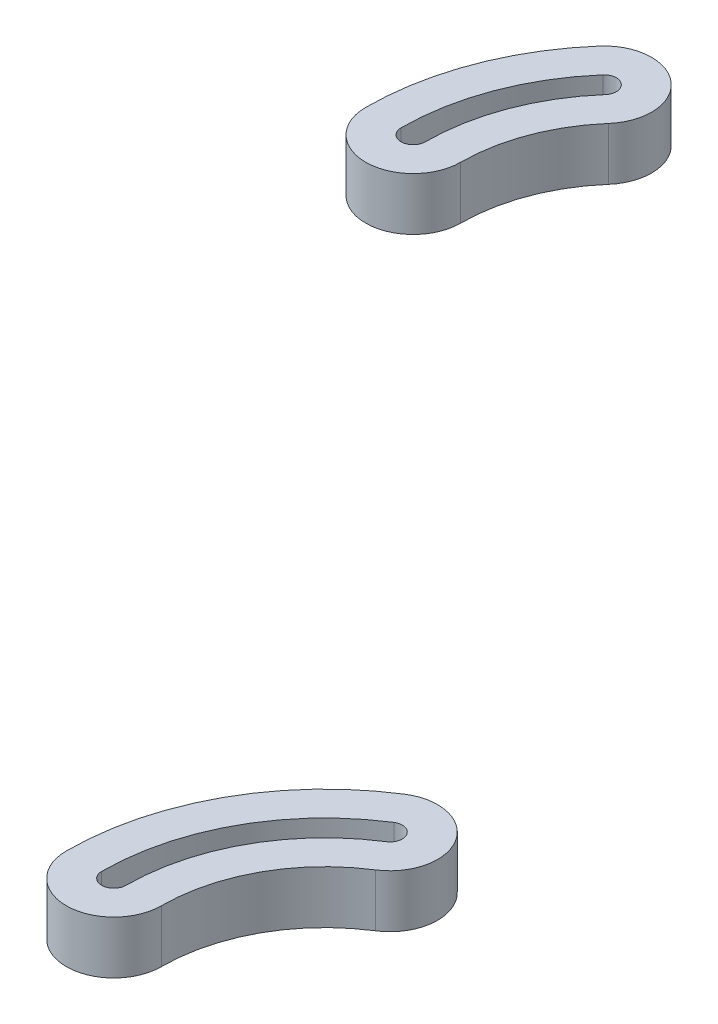
ISO-10303-21;
HEADER;
FILE_DESCRIPTION(('STEP AP214'),'2;1');
FILE_NAME('part.step','',(''),(''),'','','');
FILE_SCHEMA(('AUTOMOTIVE_DESIGN { 1 0 10303 214 1 1 1 1 }'));
ENDSEC;
DATA;
#1=APPLICATION_CONTEXT('core data for automotive mechanical design processes');
#2=APPLICATION_PROTOCOL_DEFINITION('international standard','automotive_design',2000,#1);
#3=PRODUCT_CONTEXT('',#1,'mechanical');
#4=PRODUCT('Part','Part','',(#3));
#5=PRODUCT_RELATED_PRODUCT_CATEGORY('part','',(#4));
#6=PRODUCT_DEFINITION_FORMATION('','',#4);
#7=PRODUCT_DEFINITION_CONTEXT('part definition',#1,'design');
#8=PRODUCT_DEFINITION('design','',#6,#7);
#9=PRODUCT_DEFINITION_SHAPE('','',#8);
#10=(LENGTH_UNIT() NAMED_UNIT(*) SI_UNIT(.MILLI.,.METRE.));
#11=(NAMED_UNIT(*) PLANE_ANGLE_UNIT() SI_UNIT($,.RADIAN.));
#12=(NAMED_UNIT(*) SI_UNIT($,.STERADIAN.) SOLID_ANGLE_UNIT());
#13=UNCERTAINTY_MEASURE_WITH_UNIT(LENGTH_MEASURE(1.E-05),#10,'distance_accuracy_value','');
#14=(GEOMETRIC_REPRESENTATION_CONTEXT(3) GLOBAL_UNCERTAINTY_ASSIGNED_CONTEXT((#13)) GLOBAL_UNIT_ASSIGNED_CONTEXT((#10,
#11,#12)) REPRESENTATION_CONTEXT('',''));
#15=CARTESIAN_POINT('',(0.,0.,0.));
#16=DIRECTION('',(0.,0.,1.));
#17=DIRECTION('',(1.,0.,0.));
#18=AXIS2_PLACEMENT_3D('',#15,#16,#17);
#19=CARTESIAN_POINT('',(-179.166238959109,445.3,261.544556892225));
#20=DIRECTION('',(0.,1.,0.));
#21=DIRECTION('',(0.,0.,1.));
#22=AXIS2_PLACEMENT_3D('',#19,#20,#21);
#23=CYLINDRICAL_SURFACE('',#22,49.);
#24=CARTESIAN_POINT('',(-179.166238959109,455.3,261.544556892225));
#25=DIRECTION('',(0.,1.,0.));
#26=DIRECTION('',(0.,0.,1.));
#27=AXIS2_PLACEMENT_3D('',#24,#25,#26);
#28=CIRCLE('',#27,49.);
#29=CARTESIAN_POINT('',(-216.072963974037,455.3,229.312683712521));
#30=VERTEX_POINT('',#29);
#31=CARTESIAN_POINT('',(-228.166238959109,455.3,261.544556892225));
#32=VERTEX_POINT('',#31);
#33=EDGE_CURVE('E142',#30,#32,#28,.T.);
#34=ORIENTED_EDGE('',*,*,#33,.F.);
#35=DIRECTION('',(0.,1.,0.));
#36=VECTOR('',#35,1.);
#37=CARTESIAN_POINT('',(-216.072963974037,445.3,229.312683712521));
#38=LINE('',#37,#36);
#39=CARTESIAN_POINT('',(-216.072963974037,445.3,229.312683712521));
#40=VERTEX_POINT('',#39);
#41=EDGE_CURVE('E12',#40,#30,#38,.T.);
#42=ORIENTED_EDGE('',*,*,#41,.F.);
#43=CARTESIAN_POINT('',(-179.166238959109,445.3,261.544556892225));
#44=DIRECTION('',(0.,1.,0.));
#45=DIRECTION('',(0.,0.,1.));
#46=AXIS2_PLACEMENT_3D('',#43,#44,#45);
#47=CIRCLE('',#46,49.);
#48=CARTESIAN_POINT('',(-228.166238959109,445.3,261.544556892225));
#49=VERTEX_POINT('',#48);
#50=EDGE_CURVE('E146',#40,#49,#47,.T.);
#51=ORIENTED_EDGE('',*,*,#50,.T.);
#52=DIRECTION('',(0.,1.,0.));
#53=VECTOR('',#52,1.);
#54=CARTESIAN_POINT('',(-228.166238959109,445.3,261.544556892225));
#55=LINE('',#54,#53);
#56=EDGE_CURVE('E47',#49,#32,#55,.T.);
#57=ORIENTED_EDGE('',*,*,#56,.T.);
#58=EDGE_LOOP('',(#34,#42,#51,#57));
#59=FACE_BOUND('',#58,.T.);
#60=ADVANCED_FACE('F44',(#59),#23,.T.);
#61=CARTESIAN_POINT('',(-209.294177746805,445.3,235.232823684304));
#62=DIRECTION('',(0.,1.,0.));
#63=DIRECTION('',(0.,0.,1.));
#64=AXIS2_PLACEMENT_3D('',#61,#62,#63);
#65=CYLINDRICAL_SURFACE('',#64,9.00000000000003);
#66=CARTESIAN_POINT('',(-209.294177746805,455.3,235.232823684304));
#67=DIRECTION('',(0.,1.,0.));
#68=DIRECTION('',(0.,0.,1.));
#69=AXIS2_PLACEMENT_3D('',#66,#67,#68);
#70=CIRCLE('',#69,9.00000000000003);
#71=CARTESIAN_POINT('',(-202.515391519574,455.3,241.152963656086));
#72=VERTEX_POINT('',#71);
#73=EDGE_CURVE('E150',#72,#30,#70,.T.);
#74=ORIENTED_EDGE('',*,*,#73,.F.);
#75=DIRECTION('',(0.,1.,0.));
#76=VECTOR('',#75,1.);
#77=CARTESIAN_POINT('',(-202.515391519574,445.3,241.152963656086));
#78=LINE('',#77,#76);
#79=CARTESIAN_POINT('',(-202.515391519574,445.3,241.152963656086));
#80=VERTEX_POINT('',#79);
#81=EDGE_CURVE('E52',#80,#72,#78,.T.);
#82=ORIENTED_EDGE('',*,*,#81,.F.);
#83=CARTESIAN_POINT('',(-209.294177746805,445.3,235.232823684304));
#84=DIRECTION('',(0.,1.,0.));
#85=DIRECTION('',(0.,0.,1.));
#86=AXIS2_PLACEMENT_3D('',#83,#84,#85);
#87=CIRCLE('',#86,9.00000000000003);
#88=EDGE_CURVE('E156',#80,#40,#87,.T.);
#89=ORIENTED_EDGE('',*,*,#88,.T.);
#90=ORIENTED_EDGE('',*,*,#41,.T.);
#91=EDGE_LOOP('',(#74,#82,#89,#90));
#92=FACE_BOUND('',#91,.T.);
#93=ADVANCED_FACE('F182',(#92),#65,.T.);
#94=CARTESIAN_POINT('',(-179.166238959109,445.3,261.544556892225));
#95=DIRECTION('',(0.,1.,0.));
#96=DIRECTION('',(0.,0.,1.));
#97=AXIS2_PLACEMENT_3D('',#94,#95,#96);
#98=CYLINDRICAL_SURFACE('',#97,31.);
#99=CARTESIAN_POINT('',(-179.166238959109,455.3,261.544556892225));
#100=DIRECTION('',(0.,-1.,0.));
#101=DIRECTION('',(0.,0.,1.));
#102=AXIS2_PLACEMENT_3D('',#99,#100,#101);
#103=CIRCLE('',#102,31.);
#104=CARTESIAN_POINT('',(-210.166238959109,455.3,261.544556892225));
#105=VERTEX_POINT('',#104);
#106=EDGE_CURVE('E164',#105,#72,#103,.T.);
#107=ORIENTED_EDGE('',*,*,#106,.F.);
#108=DIRECTION('',(0.,1.,0.));
#109=VECTOR('',#108,1.);
#110=CARTESIAN_POINT('',(-210.166238959109,445.3,261.544556892225));
#111=LINE('',#110,#109);
#112=CARTESIAN_POINT('',(-210.166238959109,445.3,261.544556892225));
#113=VERTEX_POINT('',#112);
#114=EDGE_CURVE('E169',#113,#105,#111,.T.);
#115=ORIENTED_EDGE('',*,*,#114,.F.);
#116=CARTESIAN_POINT('',(-179.166238959109,445.3,261.544556892225));
#117=DIRECTION('',(0.,-1.,0.));
#118=DIRECTION('',(0.,0.,1.));
#119=AXIS2_PLACEMENT_3D('',#116,#117,#118);
#120=CIRCLE('',#119,31.);
#121=EDGE_CURVE('E153',#113,#80,#120,.T.);
#122=ORIENTED_EDGE('',*,*,#121,.T.);
#123=ORIENTED_EDGE('',*,*,#81,.T.);
#124=EDGE_LOOP('',(#107,#115,#122,#123));
#125=FACE_BOUND('',#124,.T.);
#126=ADVANCED_FACE('F186',(#125),#98,.F.);
#127=CARTESIAN_POINT('',(-219.166238959109,445.3,261.544556892225));
#128=DIRECTION('',(0.,1.,0.));
#129=DIRECTION('',(0.,0.,1.));
#130=AXIS2_PLACEMENT_3D('',#127,#128,#129);
#131=CYLINDRICAL_SURFACE('',#130,9.00000000000001);
#132=CARTESIAN_POINT('',(-219.166238959109,455.3,261.544556892225));
#133=DIRECTION('',(0.,1.,0.));
#134=DIRECTION('',(0.,0.,1.));
#135=AXIS2_PLACEMENT_3D('',#132,#133,#134);
#136=CIRCLE('',#135,9.00000000000001);
#137=EDGE_CURVE('E161',#32,#105,#136,.T.);
#138=ORIENTED_EDGE('',*,*,#137,.F.);
#139=ORIENTED_EDGE('',*,*,#56,.F.);
#140=CARTESIAN_POINT('',(-219.166238959109,445.3,261.544556892225));
#141=DIRECTION('',(0.,1.,0.));
#142=DIRECTION('',(0.,0.,1.));
#143=AXIS2_PLACEMENT_3D('',#140,#141,#142);
#144=CIRCLE('',#143,9.00000000000001);
#145=EDGE_CURVE('E149',#49,#113,#144,.T.);
#146=ORIENTED_EDGE('',*,*,#145,.T.);
#147=ORIENTED_EDGE('',*,*,#114,.T.);
#148=EDGE_LOOP('',(#138,#139,#146,#147));
#149=FACE_BOUND('',#148,.T.);
#150=ADVANCED_FACE('F177',(#149),#131,.T.);
#151=CARTESIAN_POINT('',(-199.166238959109,445.3,261.544556892225));
#152=DIRECTION('',(0.,1.,0.));
#153=DIRECTION('',(0.,0.,1.));
#154=AXIS2_PLACEMENT_3D('',#151,#152,#153);
#155=PLANE('',#154);
#156=CARTESIAN_POINT('',(-209.294177746805,445.3,235.232823684304));
#157=DIRECTION('',(0.,1.,0.));
#158=DIRECTION('',(0.,0.,1.));
#159=AXIS2_PLACEMENT_3D('',#156,#157,#158);
#160=CIRCLE('',#159,2.30000000000002);
#161=CARTESIAN_POINT('',(-207.561821266513,445.3,236.745748343759));
#162=VERTEX_POINT('',#161);
#163=CARTESIAN_POINT('',(-211.026534227098,445.3,233.719899024848));
#164=VERTEX_POINT('',#163);
#165=EDGE_CURVE('E117',#162,#164,#160,.T.);
#166=ORIENTED_EDGE('',*,*,#165,.T.);
#167=CARTESIAN_POINT('',(-179.166238959109,445.3,261.544556892225));
#168=DIRECTION('',(0.,1.,0.));
#169=DIRECTION('',(0.,0.,1.));
#170=AXIS2_PLACEMENT_3D('',#167,#168,#169);
#171=CIRCLE('',#170,42.3);
#172=CARTESIAN_POINT('',(-221.466238959109,445.3,261.544556892225));
#173=VERTEX_POINT('',#172);
#174=EDGE_CURVE('E111',#164,#173,#171,.T.);
#175=ORIENTED_EDGE('',*,*,#174,.T.);
#176=CARTESIAN_POINT('',(-219.166238959109,445.3,261.544556892225));
#177=DIRECTION('',(0.,1.,0.));
#178=DIRECTION('',(0.,0.,1.));
#179=AXIS2_PLACEMENT_3D('',#176,#177,#178);
#180=CIRCLE('',#179,2.30000000000002);
#181=CARTESIAN_POINT('',(-216.866238959109,445.3,261.544556892225));
#182=VERTEX_POINT('',#181);
#183=EDGE_CURVE('E120',#173,#182,#180,.T.);
#184=ORIENTED_EDGE('',*,*,#183,.T.);
#185=CARTESIAN_POINT('',(-179.166238959109,445.3,261.544556892225));
#186=DIRECTION('',(0.,-1.,0.));
#187=DIRECTION('',(0.,0.,1.));
#188=AXIS2_PLACEMENT_3D('',#185,#186,#187);
#189=CIRCLE('',#188,37.7);
#190=EDGE_CURVE('E60',#182,#162,#189,.T.);
#191=ORIENTED_EDGE('',*,*,#190,.T.);
#192=EDGE_LOOP('',(#166,#175,#184,#191));
#193=FACE_BOUND('',#192,.T.);
#194=ORIENTED_EDGE('',*,*,#50,.F.);
#195=ORIENTED_EDGE('',*,*,#88,.F.);
#196=ORIENTED_EDGE('',*,*,#121,.F.);
#197=ORIENTED_EDGE('',*,*,#145,.F.);
#198=EDGE_LOOP('',(#194,#195,#196,#197));
#199=FACE_BOUND('',#198,.T.);
#200=ADVANCED_FACE('F124',(#193,#199),#155,.F.);
#201=CARTESIAN_POINT('',(-199.166238959109,455.3,261.544556892225));
#202=DIRECTION('',(0.,1.,0.));
#203=DIRECTION('',(0.,0.,1.));
#204=AXIS2_PLACEMENT_3D('',#201,#202,#203);
#205=PLANE('',#204);
#206=CARTESIAN_POINT('',(-179.166238959109,455.3,261.544556892225));
#207=DIRECTION('',(0.,1.,0.));
#208=DIRECTION('',(0.,0.,1.));
#209=AXIS2_PLACEMENT_3D('',#206,#207,#208);
#210=CIRCLE('',#209,42.3);
#211=CARTESIAN_POINT('',(-211.026534227098,455.3,233.719899024848));
#212=VERTEX_POINT('',#211);
#213=CARTESIAN_POINT('',(-221.466238959109,455.3,261.544556892225));
#214=VERTEX_POINT('',#213);
#215=EDGE_CURVE('E68',#212,#214,#210,.T.);
#216=ORIENTED_EDGE('',*,*,#215,.F.);
#217=CARTESIAN_POINT('',(-209.294177746805,455.3,235.232823684304));
#218=DIRECTION('',(0.,1.,0.));
#219=DIRECTION('',(0.,0.,1.));
#220=AXIS2_PLACEMENT_3D('',#217,#218,#219);
#221=CIRCLE('',#220,2.30000000000002);
#222=CARTESIAN_POINT('',(-207.561821266513,455.3,236.745748343759));
#223=VERTEX_POINT('',#222);
#224=EDGE_CURVE('E127',#223,#212,#221,.T.);
#225=ORIENTED_EDGE('',*,*,#224,.F.);
#226=CARTESIAN_POINT('',(-179.166238959109,455.3,261.544556892225));
#227=DIRECTION('',(0.,-1.,0.));
#228=DIRECTION('',(0.,0.,1.));
#229=AXIS2_PLACEMENT_3D('',#226,#227,#228);
#230=CIRCLE('',#229,37.7);
#231=CARTESIAN_POINT('',(-216.866238959109,455.3,261.544556892225));
#232=VERTEX_POINT('',#231);
#233=EDGE_CURVE('E130',#232,#223,#230,.T.);
#234=ORIENTED_EDGE('',*,*,#233,.F.);
#235=CARTESIAN_POINT('',(-219.166238959109,455.3,261.544556892225));
#236=DIRECTION('',(0.,1.,0.));
#237=DIRECTION('',(0.,0.,1.));
#238=AXIS2_PLACEMENT_3D('',#235,#236,#237);
#239=CIRCLE('',#238,2.30000000000002);
#240=EDGE_CURVE('E136',#214,#232,#239,.T.);
#241=ORIENTED_EDGE('',*,*,#240,.F.);
#242=EDGE_LOOP('',(#216,#225,#234,#241));
#243=FACE_BOUND('',#242,.T.);
#244=ORIENTED_EDGE('',*,*,#33,.T.);
#245=ORIENTED_EDGE('',*,*,#137,.T.);
#246=ORIENTED_EDGE('',*,*,#106,.T.);
#247=ORIENTED_EDGE('',*,*,#73,.T.);
#248=EDGE_LOOP('',(#244,#245,#246,#247));
#249=FACE_BOUND('',#248,.T.);
#250=ADVANCED_FACE('F179',(#243,#249),#205,.T.);
#251=CARTESIAN_POINT('',(-179.166238959109,445.3,261.544556892225));
#252=DIRECTION('',(0.,1.,0.));
#253=DIRECTION('',(0.,0.,1.));
#254=AXIS2_PLACEMENT_3D('',#251,#252,#253);
#255=CYLINDRICAL_SURFACE('',#254,42.3);
#256=ORIENTED_EDGE('',*,*,#215,.T.);
#257=DIRECTION('',(0.,1.,0.));
#258=VECTOR('',#257,1.);
#259=CARTESIAN_POINT('',(-221.466238959109,445.3,261.544556892225));
#260=LINE('',#259,#258);
#261=EDGE_CURVE('E107',#173,#214,#260,.T.);
#262=ORIENTED_EDGE('',*,*,#261,.F.);
#263=ORIENTED_EDGE('',*,*,#174,.F.);
#264=DIRECTION('',(0.,1.,0.));
#265=VECTOR('',#264,1.);
#266=CARTESIAN_POINT('',(-211.026534227098,445.3,233.719899024848));
#267=LINE('',#266,#265);
#268=EDGE_CURVE('E140',#164,#212,#267,.T.);
#269=ORIENTED_EDGE('',*,*,#268,.T.);
#270=EDGE_LOOP('',(#256,#262,#263,#269));
#271=FACE_BOUND('',#270,.T.);
#272=ADVANCED_FACE('F109',(#271),#255,.F.);
#273=CARTESIAN_POINT('',(-209.294177746805,445.3,235.232823684304));
#274=DIRECTION('',(0.,1.,0.));
#275=DIRECTION('',(0.,0.,1.));
#276=AXIS2_PLACEMENT_3D('',#273,#274,#275);
#277=CYLINDRICAL_SURFACE('',#276,2.30000000000002);
#278=ORIENTED_EDGE('',*,*,#224,.T.);
#279=ORIENTED_EDGE('',*,*,#268,.F.);
#280=ORIENTED_EDGE('',*,*,#165,.F.);
#281=DIRECTION('',(0.,1.,0.));
#282=VECTOR('',#281,1.);
#283=CARTESIAN_POINT('',(-207.561821266513,445.3,236.745748343759));
#284=LINE('',#283,#282);
#285=EDGE_CURVE('E143',#162,#223,#284,.T.);
#286=ORIENTED_EDGE('',*,*,#285,.T.);
#287=EDGE_LOOP('',(#278,#279,#280,#286));
#288=FACE_BOUND('',#287,.T.);
#289=ADVANCED_FACE('F237',(#288),#277,.F.);
#290=CARTESIAN_POINT('',(-179.166238959109,445.3,261.544556892225));
#291=DIRECTION('',(0.,1.,0.));
#292=DIRECTION('',(0.,0.,1.));
#293=AXIS2_PLACEMENT_3D('',#290,#291,#292);
#294=CYLINDRICAL_SURFACE('',#293,37.7);
#295=ORIENTED_EDGE('',*,*,#233,.T.);
#296=ORIENTED_EDGE('',*,*,#285,.F.);
#297=ORIENTED_EDGE('',*,*,#190,.F.);
#298=DIRECTION('',(0.,1.,0.));
#299=VECTOR('',#298,1.);
#300=CARTESIAN_POINT('',(-216.866238959109,445.3,261.544556892225));
#301=LINE('',#300,#299);
#302=EDGE_CURVE('E116',#182,#232,#301,.T.);
#303=ORIENTED_EDGE('',*,*,#302,.T.);
#304=EDGE_LOOP('',(#295,#296,#297,#303));
#305=FACE_BOUND('',#304,.T.);
#306=ADVANCED_FACE('F246',(#305),#294,.T.);
#307=CARTESIAN_POINT('',(-219.166238959109,445.3,261.544556892225));
#308=DIRECTION('',(0.,1.,0.));
#309=DIRECTION('',(0.,0.,1.));
#310=AXIS2_PLACEMENT_3D('',#307,#308,#309);
#311=CYLINDRICAL_SURFACE('',#310,2.30000000000002);
#312=ORIENTED_EDGE('',*,*,#240,.T.);
#313=ORIENTED_EDGE('',*,*,#302,.F.);
#314=ORIENTED_EDGE('',*,*,#183,.F.);
#315=ORIENTED_EDGE('',*,*,#261,.T.);
#316=EDGE_LOOP('',(#312,#313,#314,#315));
#317=FACE_BOUND('',#316,.T.);
#318=ADVANCED_FACE('F121',(#317),#311,.F.);
#319=CLOSED_SHELL('',(#60,#93,#126,#150,#200,#250,#272,#289,#306,#318));
#320=MANIFOLD_SOLID_BREP('B2',#319);
#321=CARTESIAN_POINT('',(-106.941386536485,445.3,378.14410632055));
#322=DIRECTION('',(0.,1.,0.));
#323=DIRECTION('',(0.,0.,1.));
#324=AXIS2_PLACEMENT_3D('',#321,#322,#323);
#325=CYLINDRICAL_SURFACE('',#324,9.00000000000001);
#326=CARTESIAN_POINT('',(-106.941386536485,455.3,378.14410632055));
#327=DIRECTION('',(0.,1.,0.));
#328=DIRECTION('',(0.,0.,1.));
#329=AXIS2_PLACEMENT_3D('',#326,#327,#328);
#330=CIRCLE('',#329,9.00000000000001);
#331=CARTESIAN_POINT('',(-102.120119655251,455.3,385.743802739482));
#332=VERTEX_POINT('',#331);
#333=CARTESIAN_POINT('',(-111.762653417718,455.3,370.544409901618));
#334=VERTEX_POINT('',#333);
#335=EDGE_CURVE('E371',#332,#334,#330,.T.);
#336=ORIENTED_EDGE('',*,*,#335,.F.);
#337=DIRECTION('',(0.,1.,0.));
#338=VECTOR('',#337,1.);
#339=CARTESIAN_POINT('',(-102.120119655251,445.3,385.743802739482));
#340=LINE('',#339,#338);
#341=CARTESIAN_POINT('',(-102.120119655251,445.3,385.743802739482));
#342=VERTEX_POINT('',#341);
#343=EDGE_CURVE('E42',#342,#332,#340,.T.);
#344=ORIENTED_EDGE('',*,*,#343,.F.);
#345=CARTESIAN_POINT('',(-106.941386536485,445.3,378.14410632055));
#346=DIRECTION('',(0.,1.,0.));
#347=DIRECTION('',(0.,0.,1.));
#348=AXIS2_PLACEMENT_3D('',#345,#346,#347);
#349=CIRCLE('',#348,9.00000000000001);
#350=CARTESIAN_POINT('',(-111.762653417718,445.3,370.544409901618));
#351=VERTEX_POINT('',#350);
#352=EDGE_CURVE('E375',#342,#351,#349,.T.);
#353=ORIENTED_EDGE('',*,*,#352,.T.);
#354=DIRECTION('',(0.,1.,0.));
#355=VECTOR('',#354,1.);
#356=CARTESIAN_POINT('',(-111.762653417718,445.3,370.544409901618));
#357=LINE('',#356,#355);
#358=EDGE_CURVE('E276',#351,#334,#357,.T.);
#359=ORIENTED_EDGE('',*,*,#358,.T.);
#360=EDGE_LOOP('',(#336,#344,#353,#359));
#361=FACE_BOUND('',#360,.T.);
#362=ADVANCED_FACE('F273',(#361),#325,.T.);
#363=CARTESIAN_POINT('',(-85.5135337310029,445.3,411.920534849135));
#364=DIRECTION('',(0.,1.,0.));
#365=DIRECTION('',(0.,0.,1.));
#366=AXIS2_PLACEMENT_3D('',#363,#364,#365);
#367=CYLINDRICAL_SURFACE('',#366,31.);
#368=CARTESIAN_POINT('',(-85.5135337310029,455.3,411.920534849135));
#369=DIRECTION('',(0.,-1.,0.));
#370=DIRECTION('',(0.,0.,1.));
#371=AXIS2_PLACEMENT_3D('',#368,#369,#370);
#372=CIRCLE('',#371,31.);
#373=CARTESIAN_POINT('',(-116.513533731003,455.3,411.920534849135));
#374=VERTEX_POINT('',#373);
#375=EDGE_CURVE('E379',#374,#332,#372,.T.);
#376=ORIENTED_EDGE('',*,*,#375,.F.);
#377=DIRECTION('',(0.,1.,0.));
#378=VECTOR('',#377,1.);
#379=CARTESIAN_POINT('',(-116.513533731003,445.3,411.920534849135));
#380=LINE('',#379,#378);
#381=CARTESIAN_POINT('',(-116.513533731003,445.3,411.920534849135));
#382=VERTEX_POINT('',#381);
#383=EDGE_CURVE('E281',#382,#374,#380,.T.);
#384=ORIENTED_EDGE('',*,*,#383,.F.);
#385=CARTESIAN_POINT('',(-85.5135337310029,445.3,411.920534849135));
#386=DIRECTION('',(0.,-1.,0.));
#387=DIRECTION('',(0.,0.,1.));
#388=AXIS2_PLACEMENT_3D('',#385,#386,#387);
#389=CIRCLE('',#388,31.);
#390=EDGE_CURVE('E385',#382,#342,#389,.T.);
#391=ORIENTED_EDGE('',*,*,#390,.T.);
#392=ORIENTED_EDGE('',*,*,#343,.T.);
#393=EDGE_LOOP('',(#376,#384,#391,#392));
#394=FACE_BOUND('',#393,.T.);
#395=ADVANCED_FACE('F411',(#394),#367,.F.);
#396=CARTESIAN_POINT('',(-125.513533731003,445.3,411.920534849135));
#397=DIRECTION('',(0.,1.,0.));
#398=DIRECTION('',(0.,0.,1.));
#399=AXIS2_PLACEMENT_3D('',#396,#397,#398);
#400=CYLINDRICAL_SURFACE('',#399,9.00000000000001);
#401=CARTESIAN_POINT('',(-125.513533731003,455.3,411.920534849135));
#402=DIRECTION('',(0.,1.,0.));
#403=DIRECTION('',(0.,0.,1.));
#404=AXIS2_PLACEMENT_3D('',#401,#402,#403);
#405=CIRCLE('',#404,9.00000000000001);
#406=CARTESIAN_POINT('',(-134.513533731003,455.3,411.920534849135));
#407=VERTEX_POINT('',#406);
#408=EDGE_CURVE('E393',#407,#374,#405,.T.);
#409=ORIENTED_EDGE('',*,*,#408,.F.);
#410=DIRECTION('',(0.,1.,0.));
#411=VECTOR('',#410,1.);
#412=CARTESIAN_POINT('',(-134.513533731003,445.3,411.920534849135));
#413=LINE('',#412,#411);
#414=CARTESIAN_POINT('',(-134.513533731003,445.3,411.920534849135));
#415=VERTEX_POINT('',#414);
#416=EDGE_CURVE('E398',#415,#407,#413,.T.);
#417=ORIENTED_EDGE('',*,*,#416,.F.);
#418=CARTESIAN_POINT('',(-125.513533731003,445.3,411.920534849135));
#419=DIRECTION('',(0.,1.,0.));
#420=DIRECTION('',(0.,0.,1.));
#421=AXIS2_PLACEMENT_3D('',#418,#419,#420);
#422=CIRCLE('',#421,9.00000000000001);
#423=EDGE_CURVE('E382',#415,#382,#422,.T.);
#424=ORIENTED_EDGE('',*,*,#423,.T.);
#425=ORIENTED_EDGE('',*,*,#383,.T.);
#426=EDGE_LOOP('',(#409,#417,#424,#425));
#427=FACE_BOUND('',#426,.T.);
#428=ADVANCED_FACE('F415',(#427),#400,.T.);
#429=CARTESIAN_POINT('',(-85.5135337310029,445.3,411.920534849135));
#430=DIRECTION('',(0.,1.,0.));
#431=DIRECTION('',(0.,0.,1.));
#432=AXIS2_PLACEMENT_3D('',#429,#430,#431);
#433=CYLINDRICAL_SURFACE('',#432,49.);
#434=CARTESIAN_POINT('',(-85.5135337310029,455.3,411.920534849135));
#435=DIRECTION('',(0.,1.,0.));
#436=DIRECTION('',(0.,0.,1.));
#437=AXIS2_PLACEMENT_3D('',#434,#435,#436);
#438=CIRCLE('',#437,49.);
#439=EDGE_CURVE('E390',#334,#407,#438,.T.);
#440=ORIENTED_EDGE('',*,*,#439,.F.);
#441=ORIENTED_EDGE('',*,*,#358,.F.);
#442=CARTESIAN_POINT('',(-85.5135337310029,445.3,411.920534849135));
#443=DIRECTION('',(0.,1.,0.));
#444=DIRECTION('',(0.,0.,1.));
#445=AXIS2_PLACEMENT_3D('',#442,#443,#444);
#446=CIRCLE('',#445,49.);
#447=EDGE_CURVE('E378',#351,#415,#446,.T.);
#448=ORIENTED_EDGE('',*,*,#447,.T.);
#449=ORIENTED_EDGE('',*,*,#416,.T.);
#450=EDGE_LOOP('',(#440,#441,#448,#449));
#451=FACE_BOUND('',#450,.T.);
#452=ADVANCED_FACE('F406',(#451),#433,.T.);
#453=CARTESIAN_POINT('',(-96.2274601337438,445.3,395.032320584842));
#454=DIRECTION('',(0.,1.,0.));
#455=DIRECTION('',(0.,0.,1.));
#456=AXIS2_PLACEMENT_3D('',#453,#454,#455);
#457=PLANE('',#456);
#458=CARTESIAN_POINT('',(-106.941386536485,445.3,378.14410632055));
#459=DIRECTION('',(0.,1.,0.));
#460=DIRECTION('',(0.,0.,1.));
#461=AXIS2_PLACEMENT_3D('',#458,#459,#460);
#462=CIRCLE('',#461,2.29999999999998);
#463=CARTESIAN_POINT('',(-105.70928500017,445.3,380.086250960944));
#464=VERTEX_POINT('',#463);
#465=CARTESIAN_POINT('',(-108.1734880728,445.3,376.201961680156));
#466=VERTEX_POINT('',#465);
#467=EDGE_CURVE('E346',#464,#466,#462,.T.);
#468=ORIENTED_EDGE('',*,*,#467,.T.);
#469=CARTESIAN_POINT('',(-85.5135337310029,445.3,411.920534849135));
#470=DIRECTION('',(0.,1.,0.));
#471=DIRECTION('',(0.,0.,1.));
#472=AXIS2_PLACEMENT_3D('',#469,#470,#471);
#473=CIRCLE('',#472,42.3);
#474=CARTESIAN_POINT('',(-127.813533731003,445.3,411.920534849135));
#475=VERTEX_POINT('',#474);
#476=EDGE_CURVE('E340',#466,#475,#473,.T.);
#477=ORIENTED_EDGE('',*,*,#476,.T.);
#478=CARTESIAN_POINT('',(-125.513533731003,445.3,411.920534849135));
#479=DIRECTION('',(0.,1.,0.));
#480=DIRECTION('',(0.,0.,1.));
#481=AXIS2_PLACEMENT_3D('',#478,#479,#480);
#482=CIRCLE('',#481,2.3);
#483=CARTESIAN_POINT('',(-123.213533731003,445.3,411.920534849135));
#484=VERTEX_POINT('',#483);
#485=EDGE_CURVE('E349',#475,#484,#482,.T.);
#486=ORIENTED_EDGE('',*,*,#485,.T.);
#487=CARTESIAN_POINT('',(-85.5135337310029,445.3,411.920534849135));
#488=DIRECTION('',(0.,-1.,0.));
#489=DIRECTION('',(0.,0.,1.));
#490=AXIS2_PLACEMENT_3D('',#487,#488,#489);
#491=CIRCLE('',#490,37.7);
#492=EDGE_CURVE('E289',#484,#464,#491,.T.);
#493=ORIENTED_EDGE('',*,*,#492,.T.);
#494=EDGE_LOOP('',(#468,#477,#486,#493));
#495=FACE_BOUND('',#494,.T.);
#496=ORIENTED_EDGE('',*,*,#352,.F.);
#497=ORIENTED_EDGE('',*,*,#390,.F.);
#498=ORIENTED_EDGE('',*,*,#423,.F.);
#499=ORIENTED_EDGE('',*,*,#447,.F.);
#500=EDGE_LOOP('',(#496,#497,#498,#499));
#501=FACE_BOUND('',#500,.T.);
#502=ADVANCED_FACE('F353',(#495,#501),#457,.F.);
#503=CARTESIAN_POINT('',(-96.2274601337438,455.3,395.032320584842));
#504=DIRECTION('',(0.,1.,0.));
#505=DIRECTION('',(0.,0.,1.));
#506=AXIS2_PLACEMENT_3D('',#503,#504,#505);
#507=PLANE('',#506);
#508=CARTESIAN_POINT('',(-85.5135337310029,455.3,411.920534849135));
#509=DIRECTION('',(0.,1.,0.));
#510=DIRECTION('',(0.,0.,1.));
#511=AXIS2_PLACEMENT_3D('',#508,#509,#510);
#512=CIRCLE('',#511,42.3);
#513=CARTESIAN_POINT('',(-108.1734880728,455.3,376.201961680156));
#514=VERTEX_POINT('',#513);
#515=CARTESIAN_POINT('',(-127.813533731003,455.3,411.920534849135));
#516=VERTEX_POINT('',#515);
#517=EDGE_CURVE('E297',#514,#516,#512,.T.);
#518=ORIENTED_EDGE('',*,*,#517,.F.);
#519=CARTESIAN_POINT('',(-106.941386536485,455.3,378.14410632055));
#520=DIRECTION('',(0.,1.,0.));
#521=DIRECTION('',(0.,0.,1.));
#522=AXIS2_PLACEMENT_3D('',#519,#520,#521);
#523=CIRCLE('',#522,2.29999999999998);
#524=CARTESIAN_POINT('',(-105.70928500017,455.3,380.086250960944));
#525=VERTEX_POINT('',#524);
#526=EDGE_CURVE('E356',#525,#514,#523,.T.);
#527=ORIENTED_EDGE('',*,*,#526,.F.);
#528=CARTESIAN_POINT('',(-85.5135337310029,455.3,411.920534849135));
#529=DIRECTION('',(0.,-1.,0.));
#530=DIRECTION('',(0.,0.,1.));
#531=AXIS2_PLACEMENT_3D('',#528,#529,#530);
#532=CIRCLE('',#531,37.7);
#533=CARTESIAN_POINT('',(-123.213533731003,455.3,411.920534849135));
#534=VERTEX_POINT('',#533);
#535=EDGE_CURVE('E359',#534,#525,#532,.T.);
#536=ORIENTED_EDGE('',*,*,#535,.F.);
#537=CARTESIAN_POINT('',(-125.513533731003,455.3,411.920534849135));
#538=DIRECTION('',(0.,1.,0.));
#539=DIRECTION('',(0.,0.,1.));
#540=AXIS2_PLACEMENT_3D('',#537,#538,#539);
#541=CIRCLE('',#540,2.3);
#542=EDGE_CURVE('E365',#516,#534,#541,.T.);
#543=ORIENTED_EDGE('',*,*,#542,.F.);
#544=EDGE_LOOP('',(#518,#527,#536,#543));
#545=FACE_BOUND('',#544,.T.);
#546=ORIENTED_EDGE('',*,*,#335,.T.);
#547=ORIENTED_EDGE('',*,*,#439,.T.);
#548=ORIENTED_EDGE('',*,*,#408,.T.);
#549=ORIENTED_EDGE('',*,*,#375,.T.);
#550=EDGE_LOOP('',(#546,#547,#548,#549));
#551=FACE_BOUND('',#550,.T.);
#552=ADVANCED_FACE('F408',(#545,#551),#507,.T.);
#553=CARTESIAN_POINT('',(-85.5135337310029,445.3,411.920534849135));
#554=DIRECTION('',(0.,1.,0.));
#555=DIRECTION('',(0.,0.,1.));
#556=AXIS2_PLACEMENT_3D('',#553,#554,#555);
#557=CYLINDRICAL_SURFACE('',#556,42.3);
#558=ORIENTED_EDGE('',*,*,#517,.T.);
#559=DIRECTION('',(0.,1.,0.));
#560=VECTOR('',#559,1.);
#561=CARTESIAN_POINT('',(-127.813533731003,445.3,411.920534849135));
#562=LINE('',#561,#560);
#563=EDGE_CURVE('E336',#475,#516,#562,.T.);
#564=ORIENTED_EDGE('',*,*,#563,.F.);
#565=ORIENTED_EDGE('',*,*,#476,.F.);
#566=DIRECTION('',(0.,1.,0.));
#567=VECTOR('',#566,1.);
#568=CARTESIAN_POINT('',(-108.1734880728,445.3,376.201961680156));
#569=LINE('',#568,#567);
#570=EDGE_CURVE('E369',#466,#514,#569,.T.);
#571=ORIENTED_EDGE('',*,*,#570,.T.);
#572=EDGE_LOOP('',(#558,#564,#565,#571));
#573=FACE_BOUND('',#572,.T.);
#574=ADVANCED_FACE('F338',(#573),#557,.F.);
#575=CARTESIAN_POINT('',(-106.941386536485,445.3,378.14410632055));
#576=DIRECTION('',(0.,1.,0.));
#577=DIRECTION('',(0.,0.,1.));
#578=AXIS2_PLACEMENT_3D('',#575,#576,#577);
#579=CYLINDRICAL_SURFACE('',#578,2.29999999999998);
#580=ORIENTED_EDGE('',*,*,#526,.T.);
#581=ORIENTED_EDGE('',*,*,#570,.F.);
#582=ORIENTED_EDGE('',*,*,#467,.F.);
#583=DIRECTION('',(0.,1.,0.));
#584=VECTOR('',#583,1.);
#585=CARTESIAN_POINT('',(-105.70928500017,445.3,380.086250960944));
#586=LINE('',#585,#584);
#587=EDGE_CURVE('E372',#464,#525,#586,.T.);
#588=ORIENTED_EDGE('',*,*,#587,.T.);
#589=EDGE_LOOP('',(#580,#581,#582,#588));
#590=FACE_BOUND('',#589,.T.);
#591=ADVANCED_FACE('F466',(#590),#579,.F.);
#592=CARTESIAN_POINT('',(-85.5135337310029,445.3,411.920534849135));
#593=DIRECTION('',(0.,1.,0.));
#594=DIRECTION('',(0.,0.,1.));
#595=AXIS2_PLACEMENT_3D('',#592,#593,#594);
#596=CYLINDRICAL_SURFACE('',#595,37.7);
#597=ORIENTED_EDGE('',*,*,#535,.T.);
#598=ORIENTED_EDGE('',*,*,#587,.F.);
#599=ORIENTED_EDGE('',*,*,#492,.F.);
#600=DIRECTION('',(0.,1.,0.));
#601=VECTOR('',#600,1.);
#602=CARTESIAN_POINT('',(-123.213533731003,445.3,411.920534849135));
#603=LINE('',#602,#601);
#604=EDGE_CURVE('E345',#484,#534,#603,.T.);
#605=ORIENTED_EDGE('',*,*,#604,.T.);
#606=EDGE_LOOP('',(#597,#598,#599,#605));
#607=FACE_BOUND('',#606,.T.);
#608=ADVANCED_FACE('F475',(#607),#596,.T.);
#609=CARTESIAN_POINT('',(-125.513533731003,445.3,411.920534849135));
#610=DIRECTION('',(0.,1.,0.));
#611=DIRECTION('',(0.,0.,1.));
#612=AXIS2_PLACEMENT_3D('',#609,#610,#611);
#613=CYLINDRICAL_SURFACE('',#612,2.3);
#614=ORIENTED_EDGE('',*,*,#542,.T.);
#615=ORIENTED_EDGE('',*,*,#604,.F.);
#616=ORIENTED_EDGE('',*,*,#485,.F.);
#617=ORIENTED_EDGE('',*,*,#563,.T.);
#618=EDGE_LOOP('',(#614,#615,#616,#617));
#619=FACE_BOUND('',#618,.T.);
#620=ADVANCED_FACE('F350',(#619),#613,.F.);
#621=CLOSED_SHELL('',(#362,#395,#428,#452,#502,#552,#574,#591,#608,#620));
#622=MANIFOLD_SOLID_BREP('B6',#621);
#623=ADVANCED_BREP_SHAPE_REPRESENTATION('',(#18,#320,#622),#14);
#624=SHAPE_DEFINITION_REPRESENTATION(#9,#623);
ENDSEC;
END-ISO-10303-21;
